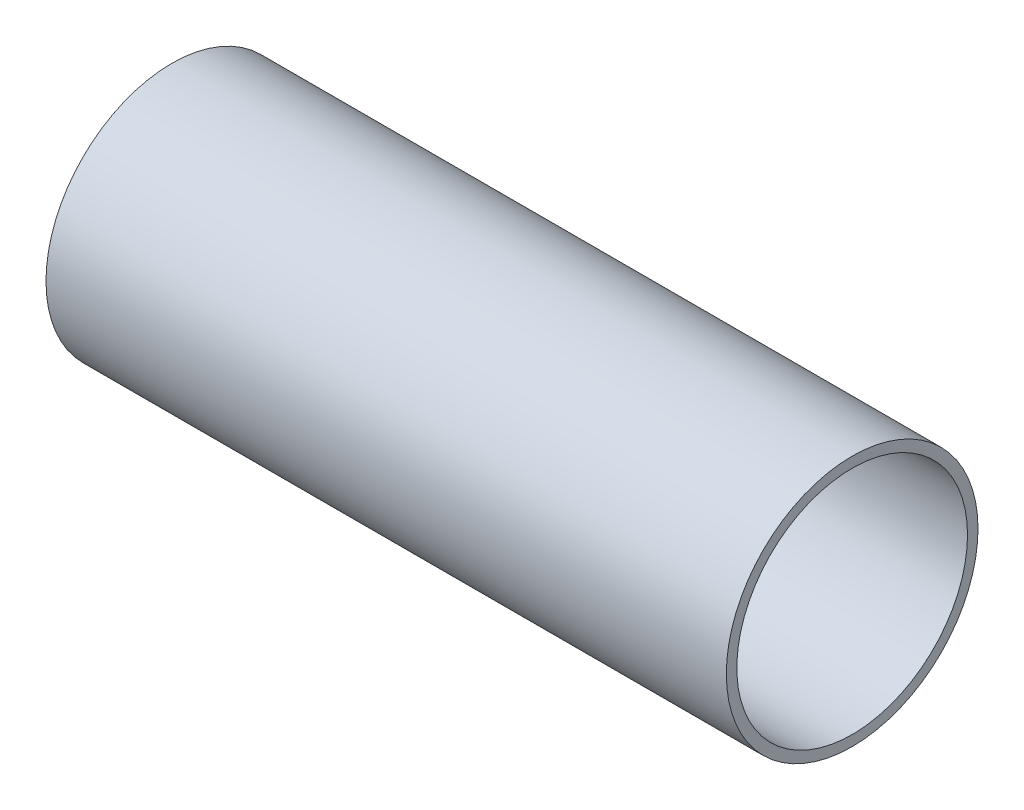
ISO-10303-21;
HEADER;
FILE_DESCRIPTION(('STEP AP214'),'2;1');
FILE_NAME('part.step','',(''),(''),'','','');
FILE_SCHEMA(('AUTOMOTIVE_DESIGN { 1 0 10303 214 1 1 1 1 }'));
ENDSEC;
DATA;
#1=APPLICATION_CONTEXT('core data for automotive mechanical design processes');
#2=APPLICATION_PROTOCOL_DEFINITION('international standard','automotive_design',2000,#1);
#3=PRODUCT_CONTEXT('',#1,'mechanical');
#4=PRODUCT('Part','Part','',(#3));
#5=PRODUCT_RELATED_PRODUCT_CATEGORY('part','',(#4));
#6=PRODUCT_DEFINITION_FORMATION('','',#4);
#7=PRODUCT_DEFINITION_CONTEXT('part definition',#1,'design');
#8=PRODUCT_DEFINITION('design','',#6,#7);
#9=PRODUCT_DEFINITION_SHAPE('','',#8);
#10=(LENGTH_UNIT() NAMED_UNIT(*) SI_UNIT(.MILLI.,.METRE.));
#11=(NAMED_UNIT(*) PLANE_ANGLE_UNIT() SI_UNIT($,.RADIAN.));
#12=(NAMED_UNIT(*) SI_UNIT($,.STERADIAN.) SOLID_ANGLE_UNIT());
#13=UNCERTAINTY_MEASURE_WITH_UNIT(LENGTH_MEASURE(1.E-05),#10,'distance_accuracy_value','');
#14=(GEOMETRIC_REPRESENTATION_CONTEXT(3) GLOBAL_UNCERTAINTY_ASSIGNED_CONTEXT((#13)) GLOBAL_UNIT_ASSIGNED_CONTEXT((#10,
#11,#12)) REPRESENTATION_CONTEXT('',''));
#15=CARTESIAN_POINT('',(0.,0.,0.));
#16=DIRECTION('',(0.,0.,1.));
#17=DIRECTION('',(1.,0.,0.));
#18=AXIS2_PLACEMENT_3D('',#15,#16,#17);
#19=CARTESIAN_POINT('',(206.,0.,0.));
#20=DIRECTION('',(1.,0.,0.));
#21=DIRECTION('',(0.,0.,-1.));
#22=AXIS2_PLACEMENT_3D('',#19,#20,#21);
#23=PLANE('',#22);
#24=CARTESIAN_POINT('',(206.,0.,0.));
#25=DIRECTION('',(1.,0.,0.));
#26=DIRECTION('',(0.,0.,-1.));
#27=AXIS2_PLACEMENT_3D('',#24,#25,#26);
#28=CIRCLE('',#27,76.2);
#29=CARTESIAN_POINT('',(206.,0.,-76.2));
#30=VERTEX_POINT('',#29);
#31=EDGE_CURVE('E10',#30,#30,#28,.T.);
#32=ORIENTED_EDGE('',*,*,#31,.T.);
#33=EDGE_LOOP('',(#32));
#34=FACE_BOUND('',#33,.T.);
#35=CARTESIAN_POINT('',(206.,0.,0.));
#36=DIRECTION('',(1.,0.,0.));
#37=DIRECTION('',(0.,0.,-1.));
#38=AXIS2_PLACEMENT_3D('',#35,#36,#37);
#39=CIRCLE('',#38,69.85);
#40=CARTESIAN_POINT('',(206.,0.,-69.85));
#41=VERTEX_POINT('',#40);
#42=EDGE_CURVE('E53',#41,#41,#39,.T.);
#43=ORIENTED_EDGE('',*,*,#42,.F.);
#44=EDGE_LOOP('',(#43));
#45=FACE_BOUND('',#44,.T.);
#46=ADVANCED_FACE('F40',(#34,#45),#23,.T.);
#47=CARTESIAN_POINT('',(-206.,0.,0.));
#48=DIRECTION('',(1.,0.,0.));
#49=DIRECTION('',(0.,0.,-1.));
#50=AXIS2_PLACEMENT_3D('',#47,#48,#49);
#51=PLANE('',#50);
#52=CARTESIAN_POINT('',(-206.,0.,0.));
#53=DIRECTION('',(1.,0.,0.));
#54=DIRECTION('',(0.,0.,-1.));
#55=AXIS2_PLACEMENT_3D('',#52,#53,#54);
#56=CIRCLE('',#55,76.2);
#57=CARTESIAN_POINT('',(-206.,0.,-76.2));
#58=VERTEX_POINT('',#57);
#59=EDGE_CURVE('E44',#58,#58,#56,.T.);
#60=ORIENTED_EDGE('',*,*,#59,.F.);
#61=EDGE_LOOP('',(#60));
#62=FACE_BOUND('',#61,.T.);
#63=CARTESIAN_POINT('',(-206.,0.,0.));
#64=DIRECTION('',(1.,0.,0.));
#65=DIRECTION('',(0.,0.,-1.));
#66=AXIS2_PLACEMENT_3D('',#63,#64,#65);
#67=CIRCLE('',#66,69.85);
#68=CARTESIAN_POINT('',(-206.,0.,-69.85));
#69=VERTEX_POINT('',#68);
#70=EDGE_CURVE('E55',#69,#69,#67,.T.);
#71=ORIENTED_EDGE('',*,*,#70,.T.);
#72=EDGE_LOOP('',(#71));
#73=FACE_BOUND('',#72,.T.);
#74=ADVANCED_FACE('F67',(#62,#73),#51,.F.);
#75=CARTESIAN_POINT('',(206.,0.,0.));
#76=DIRECTION('',(-1.,0.,0.));
#77=DIRECTION('',(0.,0.,1.));
#78=AXIS2_PLACEMENT_3D('',#75,#76,#77);
#79=CYLINDRICAL_SURFACE('',#78,76.2);
#80=ORIENTED_EDGE('',*,*,#31,.F.);
#81=EDGE_LOOP('',(#80));
#82=FACE_BOUND('',#81,.T.);
#83=ORIENTED_EDGE('',*,*,#59,.T.);
#84=EDGE_LOOP('',(#83));
#85=FACE_BOUND('',#84,.T.);
#86=ADVANCED_FACE('F42',(#82,#85),#79,.T.);
#87=CARTESIAN_POINT('',(206.,0.,0.));
#88=DIRECTION('',(-1.,0.,0.));
#89=DIRECTION('',(0.,0.,1.));
#90=AXIS2_PLACEMENT_3D('',#87,#88,#89);
#91=CYLINDRICAL_SURFACE('',#90,69.85);
#92=ORIENTED_EDGE('',*,*,#42,.T.);
#93=EDGE_LOOP('',(#92));
#94=FACE_BOUND('',#93,.T.);
#95=ORIENTED_EDGE('',*,*,#70,.F.);
#96=EDGE_LOOP('',(#95));
#97=FACE_BOUND('',#96,.T.);
#98=ADVANCED_FACE('F63',(#94,#97),#91,.F.);
#99=CLOSED_SHELL('',(#46,#74,#86,#98));
#100=MANIFOLD_SOLID_BREP('B2',#99);
#101=ADVANCED_BREP_SHAPE_REPRESENTATION('',(#18,#100),#14);
#102=SHAPE_DEFINITION_REPRESENTATION(#9,#101);
ENDSEC;
END-ISO-10303-21;
